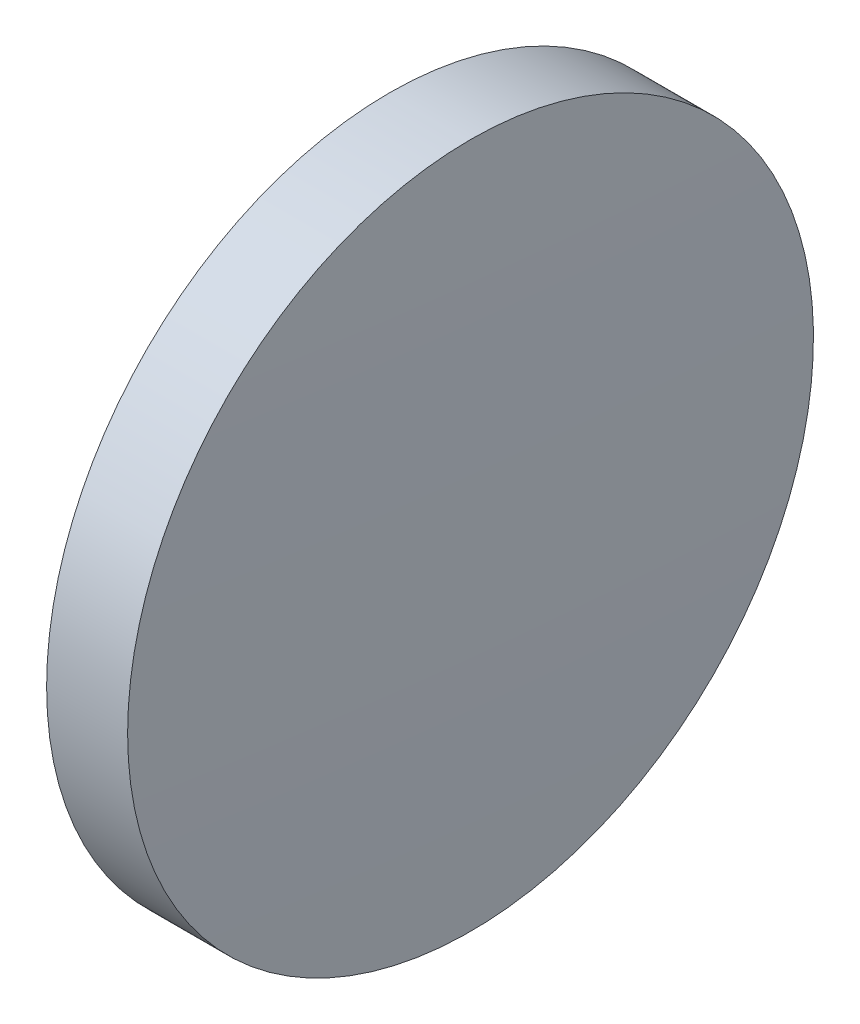
ISO-10303-21;
HEADER;
FILE_DESCRIPTION(('STEP AP214'),'2;1');
FILE_NAME('part.step','',(''),(''),'','','');
FILE_SCHEMA(('AUTOMOTIVE_DESIGN { 1 0 10303 214 1 1 1 1 }'));
ENDSEC;
DATA;
#1=APPLICATION_CONTEXT('core data for automotive mechanical design processes');
#2=APPLICATION_PROTOCOL_DEFINITION('international standard','automotive_design',2000,#1);
#3=PRODUCT_CONTEXT('',#1,'mechanical');
#4=PRODUCT('Part','Part','',(#3));
#5=PRODUCT_RELATED_PRODUCT_CATEGORY('part','',(#4));
#6=PRODUCT_DEFINITION_FORMATION('','',#4);
#7=PRODUCT_DEFINITION_CONTEXT('part definition',#1,'design');
#8=PRODUCT_DEFINITION('design','',#6,#7);
#9=PRODUCT_DEFINITION_SHAPE('','',#8);
#10=(LENGTH_UNIT() NAMED_UNIT(*) SI_UNIT(.MILLI.,.METRE.));
#11=(NAMED_UNIT(*) PLANE_ANGLE_UNIT() SI_UNIT($,.RADIAN.));
#12=(NAMED_UNIT(*) SI_UNIT($,.STERADIAN.) SOLID_ANGLE_UNIT());
#13=UNCERTAINTY_MEASURE_WITH_UNIT(LENGTH_MEASURE(1.E-05),#10,'distance_accuracy_value','');
#14=(GEOMETRIC_REPRESENTATION_CONTEXT(3) GLOBAL_UNCERTAINTY_ASSIGNED_CONTEXT((#13)) GLOBAL_UNIT_ASSIGNED_CONTEXT((#10,
#11,#12)) REPRESENTATION_CONTEXT('',''));
#15=CARTESIAN_POINT('',(0.,0.,0.));
#16=DIRECTION('',(0.,0.,1.));
#17=DIRECTION('',(1.,0.,0.));
#18=AXIS2_PLACEMENT_3D('',#15,#16,#17);
#19=CARTESIAN_POINT('',(545.855553329454,48.6161130231857,0.));
#20=DIRECTION('',(-1.,0.,0.));
#21=DIRECTION('',(0.,1.,0.));
#22=AXIS2_PLACEMENT_3D('',#19,#20,#21);
#23=SPHERICAL_SURFACE('',#22,461.072279100799);
#24=CARTESIAN_POINT('',(84.9582149175197,48.6161130231848,0.));
#25=DIRECTION('',(-1.,0.,0.));
#26=DIRECTION('',(0.,0.,1.));
#27=AXIS2_PLACEMENT_3D('',#24,#25,#26);
#28=CIRCLE('',#27,12.6999999999996);
#29=CARTESIAN_POINT('',(84.9582149175197,48.6161130231848,12.6999999999996));
#30=VERTEX_POINT('',#29);
#31=EDGE_CURVE('E46',#30,#30,#28,.T.);
#32=ORIENTED_EDGE('',*,*,#31,.T.);
#33=EDGE_LOOP('',(#32));
#34=FACE_BOUND('',#33,.T.);
#35=ADVANCED_FACE('F39',(#34),#23,.T.);
#36=CARTESIAN_POINT('',(-372.939165780228,48.6161130231846,0.));
#37=DIRECTION('',(-1.,0.,0.));
#38=DIRECTION('',(0.,1.,0.));
#39=AXIS2_PLACEMENT_3D('',#36,#37,#38);
#40=SPHERICAL_SURFACE('',#39,461.072279100898);
#41=CARTESIAN_POINT('',(87.9581726318054,48.6161130231848,0.));
#42=DIRECTION('',(-1.,0.,0.));
#43=DIRECTION('',(0.,0.,1.));
#44=AXIS2_PLACEMENT_3D('',#41,#42,#43);
#45=CIRCLE('',#44,12.7);
#46=CARTESIAN_POINT('',(87.9581726318054,48.6161130231848,12.7));
#47=VERTEX_POINT('',#46);
#48=EDGE_CURVE('E10',#47,#47,#45,.T.);
#49=ORIENTED_EDGE('',*,*,#48,.F.);
#50=EDGE_LOOP('',(#49));
#51=FACE_BOUND('',#50,.T.);
#52=ADVANCED_FACE('F56',(#51),#40,.T.);
#53=CARTESIAN_POINT('',(83.3719810515267,48.6161130231848,0.));
#54=DIRECTION('',(-1.,0.,0.));
#55=DIRECTION('',(0.,0.,1.));
#56=AXIS2_PLACEMENT_3D('',#53,#54,#55);
#57=CYLINDRICAL_SURFACE('',#56,12.6999999999998);
#58=ORIENTED_EDGE('',*,*,#48,.T.);
#59=EDGE_LOOP('',(#58));
#60=FACE_BOUND('',#59,.T.);
#61=ORIENTED_EDGE('',*,*,#31,.F.);
#62=EDGE_LOOP('',(#61));
#63=FACE_BOUND('',#62,.T.);
#64=ADVANCED_FACE('F54',(#60,#63),#57,.T.);
#65=CLOSED_SHELL('',(#35,#52,#64));
#66=MANIFOLD_SOLID_BREP('B2',#65);
#67=ADVANCED_BREP_SHAPE_REPRESENTATION('',(#18,#66),#14);
#68=SHAPE_DEFINITION_REPRESENTATION(#9,#67);
ENDSEC;
END-ISO-10303-21;
